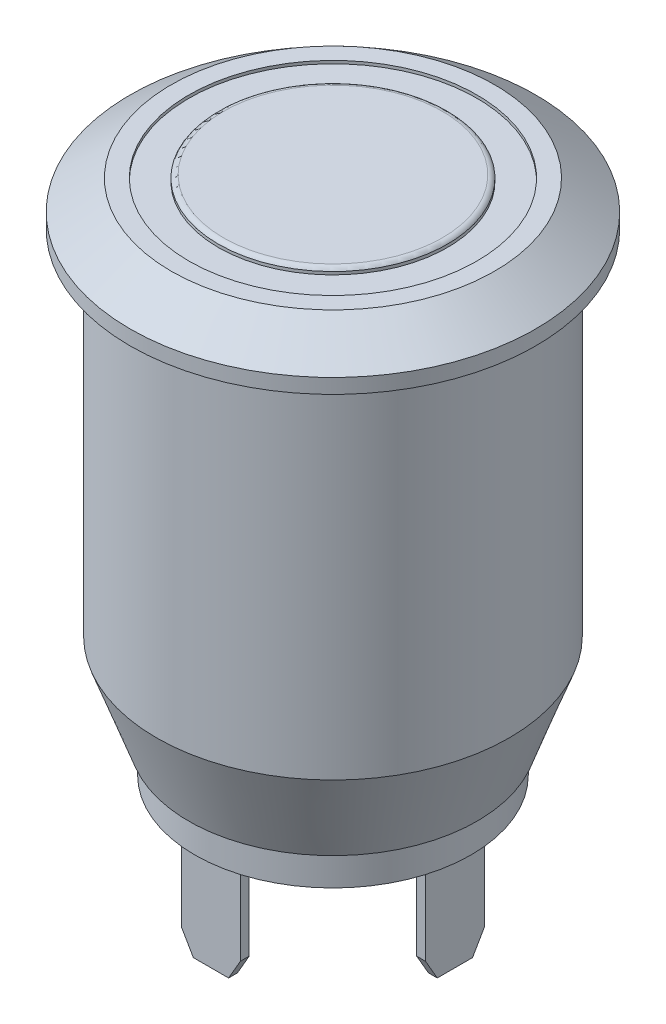
ISO-10303-21;
HEADER;
FILE_DESCRIPTION(('STEP AP214'),'2;1');
FILE_NAME('part.step','',(''),(''),'','','');
FILE_SCHEMA(('AUTOMOTIVE_DESIGN { 1 0 10303 214 1 1 1 1 }'));
ENDSEC;
DATA;
#1=APPLICATION_CONTEXT('core data for automotive mechanical design processes');
#2=APPLICATION_PROTOCOL_DEFINITION('international standard','automotive_design',2000,#1);
#3=PRODUCT_CONTEXT('',#1,'mechanical');
#4=PRODUCT('Part','Part','',(#3));
#5=PRODUCT_RELATED_PRODUCT_CATEGORY('part','',(#4));
#6=PRODUCT_DEFINITION_FORMATION('','',#4);
#7=PRODUCT_DEFINITION_CONTEXT('part definition',#1,'design');
#8=PRODUCT_DEFINITION('design','',#6,#7);
#9=PRODUCT_DEFINITION_SHAPE('','',#8);
#10=(LENGTH_UNIT() NAMED_UNIT(*) SI_UNIT(.MILLI.,.METRE.));
#11=(NAMED_UNIT(*) PLANE_ANGLE_UNIT() SI_UNIT($,.RADIAN.));
#12=(NAMED_UNIT(*) SI_UNIT($,.STERADIAN.) SOLID_ANGLE_UNIT());
#13=UNCERTAINTY_MEASURE_WITH_UNIT(LENGTH_MEASURE(1.E-05),#10,'distance_accuracy_value','');
#14=(GEOMETRIC_REPRESENTATION_CONTEXT(3) GLOBAL_UNCERTAINTY_ASSIGNED_CONTEXT((#13)) GLOBAL_UNIT_ASSIGNED_CONTEXT((#10,
#11,#12)) REPRESENTATION_CONTEXT('',''));
#15=CARTESIAN_POINT('',(0.,0.,0.));
#16=DIRECTION('',(0.,0.,1.));
#17=DIRECTION('',(1.,0.,0.));
#18=AXIS2_PLACEMENT_3D('',#15,#16,#17);
#19=CARTESIAN_POINT('',(0.,-16.1,4.7));
#20=DIRECTION('',(0.,-1.,0.));
#21=DIRECTION('',(0.,0.,-1.));
#22=AXIS2_PLACEMENT_3D('',#19,#20,#21);
#23=PLANE('',#22);
#24=CARTESIAN_POINT('',(0.,-16.1,0.));
#25=DIRECTION('',(0.,1.,0.));
#26=DIRECTION('',(0.,0.,1.));
#27=AXIS2_PLACEMENT_3D('',#24,#25,#26);
#28=CIRCLE('',#27,4.7);
#29=CARTESIAN_POINT('',(0.,-16.1,4.7));
#30=VERTEX_POINT('',#29);
#31=EDGE_CURVE('E320',#30,#30,#28,.T.);
#32=ORIENTED_EDGE('',*,*,#31,.F.);
#33=EDGE_LOOP('',(#32));
#34=FACE_BOUND('',#33,.T.);
#35=DIRECTION('',(0.,0.,-1.));
#36=VECTOR('',#35,1.);
#37=CARTESIAN_POINT('',(0.999999999999999,-16.1,4.15));
#38=LINE('',#37,#36);
#39=CARTESIAN_POINT('',(0.999999999999999,-16.1,4.15));
#40=VERTEX_POINT('',#39);
#41=CARTESIAN_POINT('',(0.999999999999999,-16.1,3.85));
#42=VERTEX_POINT('',#41);
#43=EDGE_CURVE('E295',#40,#42,#38,.T.);
#44=ORIENTED_EDGE('',*,*,#43,.T.);
#45=DIRECTION('',(1.,0.,0.));
#46=VECTOR('',#45,1.);
#47=CARTESIAN_POINT('',(-1.,-16.1,3.85));
#48=LINE('',#47,#46);
#49=CARTESIAN_POINT('',(-1.,-16.1,3.85));
#50=VERTEX_POINT('',#49);
#51=EDGE_CURVE('E284',#50,#42,#48,.T.);
#52=ORIENTED_EDGE('',*,*,#51,.F.);
#53=DIRECTION('',(0.,0.,1.));
#54=VECTOR('',#53,1.);
#55=CARTESIAN_POINT('',(-1.,-16.1,3.85));
#56=LINE('',#55,#54);
#57=CARTESIAN_POINT('',(-1.,-16.1,4.15));
#58=VERTEX_POINT('',#57);
#59=EDGE_CURVE('E289',#50,#58,#56,.T.);
#60=ORIENTED_EDGE('',*,*,#59,.T.);
#61=DIRECTION('',(1.,0.,0.));
#62=VECTOR('',#61,1.);
#63=CARTESIAN_POINT('',(-1.,-16.1,4.15));
#64=LINE('',#63,#62);
#65=EDGE_CURVE('E298',#58,#40,#64,.T.);
#66=ORIENTED_EDGE('',*,*,#65,.T.);
#67=EDGE_LOOP('',(#44,#52,#60,#66));
#68=FACE_BOUND('',#67,.T.);
#69=DIRECTION('',(0.,0.,-1.));
#70=VECTOR('',#69,1.);
#71=CARTESIAN_POINT('',(0.999999999999999,-16.1,-3.85));
#72=LINE('',#71,#70);
#73=CARTESIAN_POINT('',(0.999999999999999,-16.1,-3.85));
#74=VERTEX_POINT('',#73);
#75=CARTESIAN_POINT('',(0.999999999999999,-16.1,-4.15));
#76=VERTEX_POINT('',#75);
#77=EDGE_CURVE('E269',#74,#76,#72,.T.);
#78=ORIENTED_EDGE('',*,*,#77,.T.);
#79=DIRECTION('',(1.,0.,0.));
#80=VECTOR('',#79,1.);
#81=CARTESIAN_POINT('',(-1.,-16.1,-4.15));
#82=LINE('',#81,#80);
#83=CARTESIAN_POINT('',(-1.,-16.1,-4.15));
#84=VERTEX_POINT('',#83);
#85=EDGE_CURVE('E258',#84,#76,#82,.T.);
#86=ORIENTED_EDGE('',*,*,#85,.F.);
#87=DIRECTION('',(0.,0.,1.));
#88=VECTOR('',#87,1.);
#89=CARTESIAN_POINT('',(-1.,-16.1,-4.15));
#90=LINE('',#89,#88);
#91=CARTESIAN_POINT('',(-1.,-16.1,-3.85));
#92=VERTEX_POINT('',#91);
#93=EDGE_CURVE('E263',#84,#92,#90,.T.);
#94=ORIENTED_EDGE('',*,*,#93,.T.);
#95=DIRECTION('',(1.,0.,0.));
#96=VECTOR('',#95,1.);
#97=CARTESIAN_POINT('',(-1.,-16.1,-3.85));
#98=LINE('',#97,#96);
#99=EDGE_CURVE('E272',#92,#74,#98,.T.);
#100=ORIENTED_EDGE('',*,*,#99,.T.);
#101=EDGE_LOOP('',(#78,#86,#94,#100));
#102=FACE_BOUND('',#101,.T.);
#103=DIRECTION('',(-1.,0.,0.));
#104=VECTOR('',#103,1.);
#105=CARTESIAN_POINT('',(-3.85,-16.1,-1.));
#106=LINE('',#105,#104);
#107=CARTESIAN_POINT('',(-3.85,-16.1,-1.));
#108=VERTEX_POINT('',#107);
#109=CARTESIAN_POINT('',(-4.15,-16.1,-1.));
#110=VERTEX_POINT('',#109);
#111=EDGE_CURVE('E243',#108,#110,#106,.T.);
#112=ORIENTED_EDGE('',*,*,#111,.T.);
#113=DIRECTION('',(0.,0.,1.));
#114=VECTOR('',#113,1.);
#115=CARTESIAN_POINT('',(-4.15,-16.1,1.));
#116=LINE('',#115,#114);
#117=CARTESIAN_POINT('',(-4.15,-16.1,1.));
#118=VERTEX_POINT('',#117);
#119=EDGE_CURVE('E232',#118,#110,#116,.F.);
#120=ORIENTED_EDGE('',*,*,#119,.F.);
#121=DIRECTION('',(1.,0.,0.));
#122=VECTOR('',#121,1.);
#123=CARTESIAN_POINT('',(-4.15,-16.1,1.));
#124=LINE('',#123,#122);
#125=CARTESIAN_POINT('',(-3.85,-16.1,1.));
#126=VERTEX_POINT('',#125);
#127=EDGE_CURVE('E237',#118,#126,#124,.T.);
#128=ORIENTED_EDGE('',*,*,#127,.T.);
#129=DIRECTION('',(0.,0.,1.));
#130=VECTOR('',#129,1.);
#131=CARTESIAN_POINT('',(-3.85,-16.1,1.));
#132=LINE('',#131,#130);
#133=EDGE_CURVE('E246',#126,#108,#132,.F.);
#134=ORIENTED_EDGE('',*,*,#133,.T.);
#135=EDGE_LOOP('',(#112,#120,#128,#134));
#136=FACE_BOUND('',#135,.T.);
#137=DIRECTION('',(1.,0.,0.));
#138=VECTOR('',#137,1.);
#139=CARTESIAN_POINT('',(3.85,-16.1,1.));
#140=LINE('',#139,#138);
#141=CARTESIAN_POINT('',(3.85,-16.1,1.));
#142=VERTEX_POINT('',#141);
#143=CARTESIAN_POINT('',(4.15,-16.1,1.));
#144=VERTEX_POINT('',#143);
#145=EDGE_CURVE('E216',#142,#144,#140,.T.);
#146=ORIENTED_EDGE('',*,*,#145,.T.);
#147=DIRECTION('',(0.,0.,1.));
#148=VECTOR('',#147,1.);
#149=CARTESIAN_POINT('',(4.15,-16.1,-1.));
#150=LINE('',#149,#148);
#151=CARTESIAN_POINT('',(4.15,-16.1,-1.));
#152=VERTEX_POINT('',#151);
#153=EDGE_CURVE('E199',#152,#144,#150,.T.);
#154=ORIENTED_EDGE('',*,*,#153,.F.);
#155=DIRECTION('',(-1.,0.,0.));
#156=VECTOR('',#155,1.);
#157=CARTESIAN_POINT('',(4.15,-16.1,-1.));
#158=LINE('',#157,#156);
#159=CARTESIAN_POINT('',(3.85,-16.1,-1.));
#160=VERTEX_POINT('',#159);
#161=EDGE_CURVE('E213',#152,#160,#158,.T.);
#162=ORIENTED_EDGE('',*,*,#161,.T.);
#163=DIRECTION('',(0.,0.,1.));
#164=VECTOR('',#163,1.);
#165=CARTESIAN_POINT('',(3.85,-16.1,-1.));
#166=LINE('',#165,#164);
#167=EDGE_CURVE('E221',#160,#142,#166,.T.);
#168=ORIENTED_EDGE('',*,*,#167,.T.);
#169=EDGE_LOOP('',(#146,#154,#162,#168));
#170=FACE_BOUND('',#169,.T.);
#171=ADVANCED_FACE('F35',(#34,#68,#102,#136,#170),#23,.T.);
#172=CARTESIAN_POINT('',(0.,1.5,3.9));
#173=DIRECTION('',(0.,1.,0.));
#174=DIRECTION('',(0.,0.,1.));
#175=AXIS2_PLACEMENT_3D('',#172,#173,#174);
#176=PLANE('',#175);
#177=CARTESIAN_POINT('',(0.,1.5,0.));
#178=DIRECTION('',(0.,1.,0.));
#179=DIRECTION('',(0.,0.,1.));
#180=AXIS2_PLACEMENT_3D('',#177,#178,#179);
#181=CIRCLE('',#180,4.9);
#182=CARTESIAN_POINT('',(0.,1.5,4.9));
#183=VERTEX_POINT('',#182);
#184=EDGE_CURVE('E314',#183,#183,#181,.T.);
#185=ORIENTED_EDGE('',*,*,#184,.F.);
#186=EDGE_LOOP('',(#185));
#187=FACE_BOUND('',#186,.T.);
#188=CARTESIAN_POINT('',(0.,1.5,0.));
#189=DIRECTION('',(0.,1.,0.));
#190=DIRECTION('',(0.,0.,1.));
#191=AXIS2_PLACEMENT_3D('',#188,#189,#190);
#192=CIRCLE('',#191,5.5);
#193=CARTESIAN_POINT('',(0.,1.5,5.5));
#194=VERTEX_POINT('',#193);
#195=EDGE_CURVE('E337',#194,#194,#192,.T.);
#196=ORIENTED_EDGE('',*,*,#195,.T.);
#197=EDGE_LOOP('',(#196));
#198=FACE_BOUND('',#197,.T.);
#199=ADVANCED_FACE('F425',(#187,#198),#176,.T.);
#200=CARTESIAN_POINT('',(0.,1.5,0.));
#201=DIRECTION('',(0.,-1.,0.));
#202=DIRECTION('',(0.,0.,-1.));
#203=AXIS2_PLACEMENT_3D('',#200,#201,#202);
#204=CONICAL_SURFACE('',#203,5.5,0.950546840812076);
#205=CARTESIAN_POINT('',(0.,0.5,0.));
#206=DIRECTION('',(0.,1.,0.));
#207=DIRECTION('',(0.,0.,1.));
#208=AXIS2_PLACEMENT_3D('',#205,#206,#207);
#209=CIRCLE('',#208,6.9);
#210=CARTESIAN_POINT('',(0.,0.5,6.9));
#211=VERTEX_POINT('',#210);
#212=EDGE_CURVE('E334',#211,#211,#209,.T.);
#213=ORIENTED_EDGE('',*,*,#212,.T.);
#214=EDGE_LOOP('',(#213));
#215=FACE_BOUND('',#214,.T.);
#216=ORIENTED_EDGE('',*,*,#195,.F.);
#217=EDGE_LOOP('',(#216));
#218=FACE_BOUND('',#217,.T.);
#219=ADVANCED_FACE('F431',(#215,#218),#204,.T.);
#220=CARTESIAN_POINT('',(0.,14.375,0.));
#221=DIRECTION('',(0.,1.,0.));
#222=DIRECTION('',(0.,0.,1.));
#223=AXIS2_PLACEMENT_3D('',#220,#221,#222);
#224=CYLINDRICAL_SURFACE('',#223,6.9);
#225=CARTESIAN_POINT('',(0.,0.,0.));
#226=DIRECTION('',(0.,1.,0.));
#227=DIRECTION('',(0.,0.,1.));
#228=AXIS2_PLACEMENT_3D('',#225,#226,#227);
#229=CIRCLE('',#228,6.9);
#230=CARTESIAN_POINT('',(0.,0.,6.9));
#231=VERTEX_POINT('',#230);
#232=EDGE_CURVE('E331',#231,#231,#229,.T.);
#233=ORIENTED_EDGE('',*,*,#232,.T.);
#234=EDGE_LOOP('',(#233));
#235=FACE_BOUND('',#234,.T.);
#236=ORIENTED_EDGE('',*,*,#212,.F.);
#237=EDGE_LOOP('',(#236));
#238=FACE_BOUND('',#237,.T.);
#239=ADVANCED_FACE('F453',(#235,#238),#224,.T.);
#240=CARTESIAN_POINT('',(0.,0.,6.9));
#241=DIRECTION('',(0.,-1.,0.));
#242=DIRECTION('',(0.,0.,-1.));
#243=AXIS2_PLACEMENT_3D('',#240,#241,#242);
#244=PLANE('',#243);
#245=CARTESIAN_POINT('',(0.,0.,0.));
#246=DIRECTION('',(0.,1.,0.));
#247=DIRECTION('',(0.,0.,1.));
#248=AXIS2_PLACEMENT_3D('',#245,#246,#247);
#249=CIRCLE('',#248,6.);
#250=CARTESIAN_POINT('',(0.,0.,6.));
#251=VERTEX_POINT('',#250);
#252=EDGE_CURVE('E328',#251,#251,#249,.T.);
#253=ORIENTED_EDGE('',*,*,#252,.T.);
#254=EDGE_LOOP('',(#253));
#255=FACE_BOUND('',#254,.T.);
#256=ORIENTED_EDGE('',*,*,#232,.F.);
#257=EDGE_LOOP('',(#256));
#258=FACE_BOUND('',#257,.T.);
#259=ADVANCED_FACE('F450',(#255,#258),#244,.T.);
#260=CARTESIAN_POINT('',(0.,14.375,0.));
#261=DIRECTION('',(0.,1.,0.));
#262=DIRECTION('',(0.,0.,1.));
#263=AXIS2_PLACEMENT_3D('',#260,#261,#262);
#264=CYLINDRICAL_SURFACE('',#263,6.);
#265=CARTESIAN_POINT('',(0.,-12.,0.));
#266=DIRECTION('',(0.,-1.,0.));
#267=DIRECTION('',(0.,0.,-1.));
#268=AXIS2_PLACEMENT_3D('',#265,#266,#267);
#269=CIRCLE('',#268,6.);
#270=CARTESIAN_POINT('',(0.,-12.,-6.));
#271=VERTEX_POINT('',#270);
#272=EDGE_CURVE('E43',#271,#271,#269,.F.);
#273=ORIENTED_EDGE('',*,*,#272,.T.);
#274=EDGE_LOOP('',(#273));
#275=FACE_BOUND('',#274,.T.);
#276=ORIENTED_EDGE('',*,*,#252,.F.);
#277=EDGE_LOOP('',(#276));
#278=FACE_BOUND('',#277,.T.);
#279=ADVANCED_FACE('F413',(#275,#278),#264,.T.);
#280=CARTESIAN_POINT('',(0.,-15.,6.));
#281=DIRECTION('',(0.,-1.,0.));
#282=DIRECTION('',(0.,0.,-1.));
#283=AXIS2_PLACEMENT_3D('',#280,#281,#282);
#284=PLANE('',#283);
#285=CARTESIAN_POINT('',(0.,-15.,0.));
#286=DIRECTION('',(0.,-1.,0.));
#287=DIRECTION('',(0.,0.,-1.));
#288=AXIS2_PLACEMENT_3D('',#285,#286,#287);
#289=CIRCLE('',#288,4.90808929720139);
#290=CARTESIAN_POINT('',(0.,-15.,-4.90808929720139));
#291=VERTEX_POINT('',#290);
#292=EDGE_CURVE('E11',#291,#291,#289,.T.);
#293=ORIENTED_EDGE('',*,*,#292,.T.);
#294=EDGE_LOOP('',(#293));
#295=FACE_BOUND('',#294,.T.);
#296=CARTESIAN_POINT('',(0.,-15.,0.));
#297=DIRECTION('',(0.,1.,0.));
#298=DIRECTION('',(0.,0.,1.));
#299=AXIS2_PLACEMENT_3D('',#296,#297,#298);
#300=CIRCLE('',#299,4.7);
#301=CARTESIAN_POINT('',(0.,-15.,4.7));
#302=VERTEX_POINT('',#301);
#303=EDGE_CURVE('E325',#302,#302,#300,.T.);
#304=ORIENTED_EDGE('',*,*,#303,.T.);
#305=EDGE_LOOP('',(#304));
#306=FACE_BOUND('',#305,.T.);
#307=ADVANCED_FACE('F443',(#295,#306),#284,.T.);
#308=CARTESIAN_POINT('',(0.,14.375,0.));
#309=DIRECTION('',(0.,1.,0.));
#310=DIRECTION('',(0.,0.,1.));
#311=AXIS2_PLACEMENT_3D('',#308,#309,#310);
#312=CYLINDRICAL_SURFACE('',#311,4.7);
#313=ORIENTED_EDGE('',*,*,#31,.T.);
#314=EDGE_LOOP('',(#313));
#315=FACE_BOUND('',#314,.T.);
#316=ORIENTED_EDGE('',*,*,#303,.F.);
#317=EDGE_LOOP('',(#316));
#318=FACE_BOUND('',#317,.T.);
#319=ADVANCED_FACE('F440',(#315,#318),#312,.T.);
#320=CARTESIAN_POINT('',(0.,1.4,0.));
#321=DIRECTION('',(0.,1.,0.));
#322=DIRECTION('',(0.,0.,1.));
#323=AXIS2_PLACEMENT_3D('',#320,#321,#322);
#324=CYLINDRICAL_SURFACE('',#323,4.9);
#325=CARTESIAN_POINT('',(0.,1.4,0.));
#326=DIRECTION('',(0.,1.,0.));
#327=DIRECTION('',(0.,0.,1.));
#328=AXIS2_PLACEMENT_3D('',#325,#326,#327);
#329=CIRCLE('',#328,4.9);
#330=CARTESIAN_POINT('',(0.,1.4,4.9));
#331=VERTEX_POINT('',#330);
#332=EDGE_CURVE('E317',#331,#331,#329,.T.);
#333=ORIENTED_EDGE('',*,*,#332,.F.);
#334=EDGE_LOOP('',(#333));
#335=FACE_BOUND('',#334,.T.);
#336=ORIENTED_EDGE('',*,*,#184,.T.);
#337=EDGE_LOOP('',(#336));
#338=FACE_BOUND('',#337,.T.);
#339=ADVANCED_FACE('F438',(#335,#338),#324,.F.);
#340=CARTESIAN_POINT('',(0.,1.4,0.));
#341=DIRECTION('',(0.,1.,0.));
#342=DIRECTION('',(0.,0.,1.));
#343=AXIS2_PLACEMENT_3D('',#340,#341,#342);
#344=PLANE('',#343);
#345=CARTESIAN_POINT('',(0.,1.4,0.));
#346=DIRECTION('',(0.,1.,0.));
#347=DIRECTION('',(0.,0.,1.));
#348=AXIS2_PLACEMENT_3D('',#345,#346,#347);
#349=CIRCLE('',#348,3.9);
#350=CARTESIAN_POINT('',(0.,1.4,3.9));
#351=VERTEX_POINT('',#350);
#352=EDGE_CURVE('E311',#351,#351,#349,.T.);
#353=ORIENTED_EDGE('',*,*,#352,.F.);
#354=EDGE_LOOP('',(#353));
#355=FACE_BOUND('',#354,.T.);
#356=ORIENTED_EDGE('',*,*,#332,.T.);
#357=EDGE_LOOP('',(#356));
#358=FACE_BOUND('',#357,.T.);
#359=ADVANCED_FACE('F584',(#355,#358),#344,.T.);
#360=CARTESIAN_POINT('',(0.,1.4,0.));
#361=DIRECTION('',(0.,1.,0.));
#362=DIRECTION('',(0.,0.,1.));
#363=AXIS2_PLACEMENT_3D('',#360,#361,#362);
#364=CYLINDRICAL_SURFACE('',#363,3.9);
#365=ORIENTED_EDGE('',*,*,#352,.T.);
#366=EDGE_LOOP('',(#365));
#367=FACE_BOUND('',#366,.T.);
#368=CARTESIAN_POINT('',(0.,1.5,0.));
#369=DIRECTION('',(0.,1.,0.));
#370=DIRECTION('',(0.,0.,1.));
#371=AXIS2_PLACEMENT_3D('',#368,#369,#370);
#372=CIRCLE('',#371,3.9);
#373=CARTESIAN_POINT('',(0.,1.5,3.9));
#374=VERTEX_POINT('',#373);
#375=EDGE_CURVE('E310',#374,#374,#372,.T.);
#376=ORIENTED_EDGE('',*,*,#375,.F.);
#377=EDGE_LOOP('',(#376));
#378=FACE_BOUND('',#377,.T.);
#379=ADVANCED_FACE('F465',(#367,#378),#364,.T.);
#380=CARTESIAN_POINT('',(0.,1.6,0.));
#381=DIRECTION('',(0.,1.,0.));
#382=DIRECTION('',(0.,0.,1.));
#383=AXIS2_PLACEMENT_3D('',#380,#381,#382);
#384=PLANE('',#383);
#385=CARTESIAN_POINT('',(0.,1.6,0.));
#386=DIRECTION('',(0.,1.,0.));
#387=DIRECTION('',(0.,0.,1.));
#388=AXIS2_PLACEMENT_3D('',#385,#386,#387);
#389=CIRCLE('',#388,3.72679491924311);
#390=CARTESIAN_POINT('',(0.,1.6,3.72679491924311));
#391=VERTEX_POINT('',#390);
#392=EDGE_CURVE('E340',#391,#391,#389,.T.);
#393=ORIENTED_EDGE('',*,*,#392,.T.);
#394=EDGE_LOOP('',(#393));
#395=FACE_BOUND('',#394,.T.);
#396=ADVANCED_FACE('F461',(#395),#384,.T.);
#397=CARTESIAN_POINT('',(0.,1.4,0.));
#398=DIRECTION('',(0.,-1.,0.));
#399=DIRECTION('',(0.,0.,-1.));
#400=AXIS2_PLACEMENT_3D('',#397,#398,#399);
#401=TOROIDAL_SURFACE('',#400,3.72679491924311,0.2);
#402=ORIENTED_EDGE('',*,*,#375,.T.);
#403=EDGE_LOOP('',(#402));
#404=FACE_BOUND('',#403,.T.);
#405=ORIENTED_EDGE('',*,*,#392,.F.);
#406=EDGE_LOOP('',(#405));
#407=FACE_BOUND('',#406,.T.);
#408=ADVANCED_FACE('F464',(#404,#407),#401,.T.);
#409=CARTESIAN_POINT('',(-1.,-19.7,3.85));
#410=DIRECTION('',(0.,0.,1.));
#411=DIRECTION('',(1.,0.,0.));
#412=AXIS2_PLACEMENT_3D('',#409,#410,#411);
#413=PLANE('',#412);
#414=DIRECTION('',(1.,0.,0.));
#415=VECTOR('',#414,1.);
#416=CARTESIAN_POINT('',(-1.,-19.7,3.85));
#417=LINE('',#416,#415);
#418=CARTESIAN_POINT('',(-0.600000000000001,-19.7,3.85));
#419=VERTEX_POINT('',#418);
#420=CARTESIAN_POINT('',(0.6,-19.7,3.85));
#421=VERTEX_POINT('',#420);
#422=EDGE_CURVE('E285',#419,#421,#417,.T.);
#423=ORIENTED_EDGE('',*,*,#422,.F.);
#424=DIRECTION('',(-0.499999999999998,0.86602540378444,0.));
#425=VECTOR('',#424,1.);
#426=CARTESIAN_POINT('',(-1.,-19.0071796769724,3.85));
#427=LINE('',#426,#425);
#428=CARTESIAN_POINT('',(-1.,-19.0071796769724,3.85));
#429=VERTEX_POINT('',#428);
#430=EDGE_CURVE('E356',#419,#429,#427,.T.);
#431=ORIENTED_EDGE('',*,*,#430,.T.);
#432=DIRECTION('',(0.,1.,0.));
#433=VECTOR('',#432,1.);
#434=CARTESIAN_POINT('',(-1.,-19.7,3.85));
#435=LINE('',#434,#433);
#436=EDGE_CURVE('E292',#429,#50,#435,.T.);
#437=ORIENTED_EDGE('',*,*,#436,.T.);
#438=ORIENTED_EDGE('',*,*,#51,.T.);
#439=DIRECTION('',(0.,1.,0.));
#440=VECTOR('',#439,1.);
#441=CARTESIAN_POINT('',(0.999999999999999,-19.7,3.85));
#442=LINE('',#441,#440);
#443=CARTESIAN_POINT('',(0.999999999999999,-19.0071796769724,3.85));
#444=VERTEX_POINT('',#443);
#445=EDGE_CURVE('E308',#444,#42,#442,.T.);
#446=ORIENTED_EDGE('',*,*,#445,.F.);
#447=DIRECTION('',(-0.499999999999998,-0.86602540378444,0.));
#448=VECTOR('',#447,1.);
#449=CARTESIAN_POINT('',(0.999999999999999,-19.0071796769724,3.85));
#450=LINE('',#449,#448);
#451=EDGE_CURVE('E354',#444,#421,#450,.T.);
#452=ORIENTED_EDGE('',*,*,#451,.T.);
#453=EDGE_LOOP('',(#423,#431,#437,#438,#446,#452));
#454=FACE_BOUND('',#453,.T.);
#455=ADVANCED_FACE('F469',(#454),#413,.F.);
#456=CARTESIAN_POINT('',(0.999999999999999,-19.7,4.15));
#457=DIRECTION('',(1.,0.,0.));
#458=DIRECTION('',(0.,0.,-1.));
#459=AXIS2_PLACEMENT_3D('',#456,#457,#458);
#460=PLANE('',#459);
#461=DIRECTION('',(0.,1.,0.));
#462=VECTOR('',#461,1.);
#463=CARTESIAN_POINT('',(0.999999999999999,-19.7,4.15));
#464=LINE('',#463,#462);
#465=CARTESIAN_POINT('',(0.999999999999999,-19.0071796769724,4.15));
#466=VERTEX_POINT('',#465);
#467=EDGE_CURVE('E306',#466,#40,#464,.T.);
#468=ORIENTED_EDGE('',*,*,#467,.F.);
#469=DIRECTION('',(0.,0.,-1.));
#470=VECTOR('',#469,1.);
#471=CARTESIAN_POINT('',(0.999999999999999,-19.0071796769724,3.85));
#472=LINE('',#471,#470);
#473=EDGE_CURVE('E358',#466,#444,#472,.T.);
#474=ORIENTED_EDGE('',*,*,#473,.T.);
#475=ORIENTED_EDGE('',*,*,#445,.T.);
#476=ORIENTED_EDGE('',*,*,#43,.F.);
#477=EDGE_LOOP('',(#468,#474,#475,#476));
#478=FACE_BOUND('',#477,.T.);
#479=ADVANCED_FACE('F575',(#478),#460,.T.);
#480=CARTESIAN_POINT('',(-1.,-19.7,4.15));
#481=DIRECTION('',(0.,0.,1.));
#482=DIRECTION('',(1.,0.,0.));
#483=AXIS2_PLACEMENT_3D('',#480,#481,#482);
#484=PLANE('',#483);
#485=DIRECTION('',(0.,1.,0.));
#486=VECTOR('',#485,1.);
#487=CARTESIAN_POINT('',(-1.,-19.7,4.15));
#488=LINE('',#487,#486);
#489=CARTESIAN_POINT('',(-1.,-19.0071796769724,4.15));
#490=VERTEX_POINT('',#489);
#491=EDGE_CURVE('E304',#490,#58,#488,.T.);
#492=ORIENTED_EDGE('',*,*,#491,.F.);
#493=DIRECTION('',(0.499999999999998,-0.86602540378444,0.));
#494=VECTOR('',#493,1.);
#495=CARTESIAN_POINT('',(-0.700000000000001,-19.5267949192431,4.15));
#496=LINE('',#495,#494);
#497=CARTESIAN_POINT('',(-0.600000000000001,-19.7,4.15));
#498=VERTEX_POINT('',#497);
#499=EDGE_CURVE('E348',#490,#498,#496,.T.);
#500=ORIENTED_EDGE('',*,*,#499,.T.);
#501=DIRECTION('',(1.,0.,0.));
#502=VECTOR('',#501,1.);
#503=CARTESIAN_POINT('',(-1.,-19.7,4.15));
#504=LINE('',#503,#502);
#505=CARTESIAN_POINT('',(0.6,-19.7,4.15));
#506=VERTEX_POINT('',#505);
#507=EDGE_CURVE('E288',#498,#506,#504,.T.);
#508=ORIENTED_EDGE('',*,*,#507,.T.);
#509=DIRECTION('',(0.499999999999998,0.86602540378444,0.));
#510=VECTOR('',#509,1.);
#511=CARTESIAN_POINT('',(0.200000000000002,-20.3928203230275,4.15));
#512=LINE('',#511,#510);
#513=EDGE_CURVE('E346',#506,#466,#512,.T.);
#514=ORIENTED_EDGE('',*,*,#513,.T.);
#515=ORIENTED_EDGE('',*,*,#467,.T.);
#516=ORIENTED_EDGE('',*,*,#65,.F.);
#517=EDGE_LOOP('',(#492,#500,#508,#514,#515,#516));
#518=FACE_BOUND('',#517,.T.);
#519=ADVANCED_FACE('F571',(#518),#484,.T.);
#520=CARTESIAN_POINT('',(-1.,-19.7,3.85));
#521=DIRECTION('',(-1.,0.,0.));
#522=DIRECTION('',(0.,0.,1.));
#523=AXIS2_PLACEMENT_3D('',#520,#521,#522);
#524=PLANE('',#523);
#525=ORIENTED_EDGE('',*,*,#436,.F.);
#526=DIRECTION('',(0.,0.,1.));
#527=VECTOR('',#526,1.);
#528=CARTESIAN_POINT('',(-1.,-19.0071796769724,4.15));
#529=LINE('',#528,#527);
#530=EDGE_CURVE('E343',#429,#490,#529,.T.);
#531=ORIENTED_EDGE('',*,*,#530,.T.);
#532=ORIENTED_EDGE('',*,*,#491,.T.);
#533=ORIENTED_EDGE('',*,*,#59,.F.);
#534=EDGE_LOOP('',(#525,#531,#532,#533));
#535=FACE_BOUND('',#534,.T.);
#536=ADVANCED_FACE('F567',(#535),#524,.T.);
#537=CARTESIAN_POINT('',(0.,-19.7,0.));
#538=DIRECTION('',(0.,1.,0.));
#539=DIRECTION('',(-1.,0.,0.));
#540=AXIS2_PLACEMENT_3D('',#537,#538,#539);
#541=PLANE('',#540);
#542=ORIENTED_EDGE('',*,*,#507,.F.);
#543=DIRECTION('',(0.,0.,-1.));
#544=VECTOR('',#543,1.);
#545=CARTESIAN_POINT('',(-0.600000000000001,-19.7,3.85));
#546=LINE('',#545,#544);
#547=EDGE_CURVE('E352',#498,#419,#546,.T.);
#548=ORIENTED_EDGE('',*,*,#547,.T.);
#549=ORIENTED_EDGE('',*,*,#422,.T.);
#550=DIRECTION('',(0.,0.,1.));
#551=VECTOR('',#550,1.);
#552=CARTESIAN_POINT('',(0.6,-19.7,4.15));
#553=LINE('',#552,#551);
#554=EDGE_CURVE('E350',#421,#506,#553,.T.);
#555=ORIENTED_EDGE('',*,*,#554,.T.);
#556=EDGE_LOOP('',(#542,#548,#549,#555));
#557=FACE_BOUND('',#556,.T.);
#558=ADVANCED_FACE('F563',(#557),#541,.F.);
#559=CARTESIAN_POINT('',(-1.,-19.7,-4.15));
#560=DIRECTION('',(0.,0.,1.));
#561=DIRECTION('',(1.,0.,0.));
#562=AXIS2_PLACEMENT_3D('',#559,#560,#561);
#563=PLANE('',#562);
#564=DIRECTION('',(1.,0.,0.));
#565=VECTOR('',#564,1.);
#566=CARTESIAN_POINT('',(-1.,-19.7,-4.15));
#567=LINE('',#566,#565);
#568=CARTESIAN_POINT('',(-0.600000000000001,-19.7,-4.15));
#569=VERTEX_POINT('',#568);
#570=CARTESIAN_POINT('',(0.6,-19.7,-4.15));
#571=VERTEX_POINT('',#570);
#572=EDGE_CURVE('E259',#569,#571,#567,.T.);
#573=ORIENTED_EDGE('',*,*,#572,.F.);
#574=DIRECTION('',(-0.499999999999998,0.86602540378444,0.));
#575=VECTOR('',#574,1.);
#576=CARTESIAN_POINT('',(-1.,-19.0071796769724,-4.15));
#577=LINE('',#576,#575);
#578=CARTESIAN_POINT('',(-1.,-19.0071796769724,-4.15));
#579=VERTEX_POINT('',#578);
#580=EDGE_CURVE('E392',#569,#579,#577,.T.);
#581=ORIENTED_EDGE('',*,*,#580,.T.);
#582=DIRECTION('',(0.,1.,0.));
#583=VECTOR('',#582,1.);
#584=CARTESIAN_POINT('',(-1.,-19.7,-4.15));
#585=LINE('',#584,#583);
#586=EDGE_CURVE('E266',#579,#84,#585,.T.);
#587=ORIENTED_EDGE('',*,*,#586,.T.);
#588=ORIENTED_EDGE('',*,*,#85,.T.);
#589=DIRECTION('',(0.,1.,0.));
#590=VECTOR('',#589,1.);
#591=CARTESIAN_POINT('',(0.999999999999999,-19.7,-4.15));
#592=LINE('',#591,#590);
#593=CARTESIAN_POINT('',(0.999999999999999,-19.0071796769724,-4.15));
#594=VERTEX_POINT('',#593);
#595=EDGE_CURVE('E282',#594,#76,#592,.T.);
#596=ORIENTED_EDGE('',*,*,#595,.F.);
#597=DIRECTION('',(-0.499999999999998,-0.86602540378444,0.));
#598=VECTOR('',#597,1.);
#599=CARTESIAN_POINT('',(0.999999999999999,-19.0071796769724,-4.15));
#600=LINE('',#599,#598);
#601=EDGE_CURVE('E390',#594,#571,#600,.T.);
#602=ORIENTED_EDGE('',*,*,#601,.T.);
#603=EDGE_LOOP('',(#573,#581,#587,#588,#596,#602));
#604=FACE_BOUND('',#603,.T.);
#605=ADVANCED_FACE('F559',(#604),#563,.F.);
#606=CARTESIAN_POINT('',(0.999999999999999,-19.7,-3.85));
#607=DIRECTION('',(1.,0.,0.));
#608=DIRECTION('',(0.,0.,-1.));
#609=AXIS2_PLACEMENT_3D('',#606,#607,#608);
#610=PLANE('',#609);
#611=DIRECTION('',(0.,1.,0.));
#612=VECTOR('',#611,1.);
#613=CARTESIAN_POINT('',(0.999999999999999,-19.7,-3.85));
#614=LINE('',#613,#612);
#615=CARTESIAN_POINT('',(0.999999999999999,-19.0071796769724,-3.85));
#616=VERTEX_POINT('',#615);
#617=EDGE_CURVE('E280',#616,#74,#614,.T.);
#618=ORIENTED_EDGE('',*,*,#617,.F.);
#619=DIRECTION('',(0.,0.,-1.));
#620=VECTOR('',#619,1.);
#621=CARTESIAN_POINT('',(0.999999999999999,-19.0071796769724,-4.15));
#622=LINE('',#621,#620);
#623=EDGE_CURVE('E394',#616,#594,#622,.T.);
#624=ORIENTED_EDGE('',*,*,#623,.T.);
#625=ORIENTED_EDGE('',*,*,#595,.T.);
#626=ORIENTED_EDGE('',*,*,#77,.F.);
#627=EDGE_LOOP('',(#618,#624,#625,#626));
#628=FACE_BOUND('',#627,.T.);
#629=ADVANCED_FACE('F555',(#628),#610,.T.);
#630=CARTESIAN_POINT('',(-1.,-19.7,-3.85));
#631=DIRECTION('',(0.,0.,1.));
#632=DIRECTION('',(1.,0.,0.));
#633=AXIS2_PLACEMENT_3D('',#630,#631,#632);
#634=PLANE('',#633);
#635=DIRECTION('',(0.,1.,0.));
#636=VECTOR('',#635,1.);
#637=CARTESIAN_POINT('',(-1.,-19.7,-3.85));
#638=LINE('',#637,#636);
#639=CARTESIAN_POINT('',(-1.,-19.0071796769724,-3.85));
#640=VERTEX_POINT('',#639);
#641=EDGE_CURVE('E278',#640,#92,#638,.T.);
#642=ORIENTED_EDGE('',*,*,#641,.F.);
#643=DIRECTION('',(0.499999999999998,-0.86602540378444,0.));
#644=VECTOR('',#643,1.);
#645=CARTESIAN_POINT('',(-0.700000000000001,-19.5267949192431,-3.85));
#646=LINE('',#645,#644);
#647=CARTESIAN_POINT('',(-0.600000000000001,-19.7,-3.85));
#648=VERTEX_POINT('',#647);
#649=EDGE_CURVE('E384',#640,#648,#646,.T.);
#650=ORIENTED_EDGE('',*,*,#649,.T.);
#651=DIRECTION('',(1.,0.,0.));
#652=VECTOR('',#651,1.);
#653=CARTESIAN_POINT('',(-1.,-19.7,-3.85));
#654=LINE('',#653,#652);
#655=CARTESIAN_POINT('',(0.6,-19.7,-3.85));
#656=VERTEX_POINT('',#655);
#657=EDGE_CURVE('E262',#648,#656,#654,.T.);
#658=ORIENTED_EDGE('',*,*,#657,.T.);
#659=DIRECTION('',(0.499999999999998,0.86602540378444,0.));
#660=VECTOR('',#659,1.);
#661=CARTESIAN_POINT('',(0.200000000000002,-20.3928203230275,-3.85));
#662=LINE('',#661,#660);
#663=EDGE_CURVE('E382',#656,#616,#662,.T.);
#664=ORIENTED_EDGE('',*,*,#663,.T.);
#665=ORIENTED_EDGE('',*,*,#617,.T.);
#666=ORIENTED_EDGE('',*,*,#99,.F.);
#667=EDGE_LOOP('',(#642,#650,#658,#664,#665,#666));
#668=FACE_BOUND('',#667,.T.);
#669=ADVANCED_FACE('F551',(#668),#634,.T.);
#670=CARTESIAN_POINT('',(-1.,-19.7,-4.15));
#671=DIRECTION('',(-1.,0.,0.));
#672=DIRECTION('',(0.,0.,1.));
#673=AXIS2_PLACEMENT_3D('',#670,#671,#672);
#674=PLANE('',#673);
#675=ORIENTED_EDGE('',*,*,#586,.F.);
#676=DIRECTION('',(0.,0.,1.));
#677=VECTOR('',#676,1.);
#678=CARTESIAN_POINT('',(-1.,-19.0071796769724,-3.85));
#679=LINE('',#678,#677);
#680=EDGE_CURVE('E379',#579,#640,#679,.T.);
#681=ORIENTED_EDGE('',*,*,#680,.T.);
#682=ORIENTED_EDGE('',*,*,#641,.T.);
#683=ORIENTED_EDGE('',*,*,#93,.F.);
#684=EDGE_LOOP('',(#675,#681,#682,#683));
#685=FACE_BOUND('',#684,.T.);
#686=ADVANCED_FACE('F547',(#685),#674,.T.);
#687=CARTESIAN_POINT('',(0.,-19.7,0.));
#688=DIRECTION('',(0.,1.,0.));
#689=DIRECTION('',(-1.,0.,0.));
#690=AXIS2_PLACEMENT_3D('',#687,#688,#689);
#691=PLANE('',#690);
#692=ORIENTED_EDGE('',*,*,#657,.F.);
#693=DIRECTION('',(0.,0.,-1.));
#694=VECTOR('',#693,1.);
#695=CARTESIAN_POINT('',(-0.600000000000001,-19.7,-4.15));
#696=LINE('',#695,#694);
#697=EDGE_CURVE('E388',#648,#569,#696,.T.);
#698=ORIENTED_EDGE('',*,*,#697,.T.);
#699=ORIENTED_EDGE('',*,*,#572,.T.);
#700=DIRECTION('',(0.,0.,1.));
#701=VECTOR('',#700,1.);
#702=CARTESIAN_POINT('',(0.6,-19.7,-3.85));
#703=LINE('',#702,#701);
#704=EDGE_CURVE('E386',#571,#656,#703,.T.);
#705=ORIENTED_EDGE('',*,*,#704,.T.);
#706=EDGE_LOOP('',(#692,#698,#699,#705));
#707=FACE_BOUND('',#706,.T.);
#708=ADVANCED_FACE('F543',(#707),#691,.F.);
#709=CARTESIAN_POINT('',(-4.15,-19.7,1.));
#710=DIRECTION('',(1.,0.,0.));
#711=DIRECTION('',(0.,0.,-1.));
#712=AXIS2_PLACEMENT_3D('',#709,#710,#711);
#713=PLANE('',#712);
#714=DIRECTION('',(0.,0.,1.));
#715=VECTOR('',#714,1.);
#716=CARTESIAN_POINT('',(-4.15,-19.7,1.));
#717=LINE('',#716,#715);
#718=CARTESIAN_POINT('',(-4.15,-19.7,0.600000000000001));
#719=VERTEX_POINT('',#718);
#720=CARTESIAN_POINT('',(-4.15,-19.7,-0.600000000000001));
#721=VERTEX_POINT('',#720);
#722=EDGE_CURVE('E233',#719,#721,#717,.F.);
#723=ORIENTED_EDGE('',*,*,#722,.F.);
#724=DIRECTION('',(0.,-0.86602540378444,-0.499999999999998));
#725=VECTOR('',#724,1.);
#726=CARTESIAN_POINT('',(-4.15,-19.0071796769724,1.));
#727=LINE('',#726,#725);
#728=CARTESIAN_POINT('',(-4.15,-19.0071796769724,1.));
#729=VERTEX_POINT('',#728);
#730=EDGE_CURVE('E374',#719,#729,#727,.F.);
#731=ORIENTED_EDGE('',*,*,#730,.T.);
#732=DIRECTION('',(0.,1.,0.));
#733=VECTOR('',#732,1.);
#734=CARTESIAN_POINT('',(-4.15,-19.7,1.));
#735=LINE('',#734,#733);
#736=EDGE_CURVE('E240',#729,#118,#735,.T.);
#737=ORIENTED_EDGE('',*,*,#736,.T.);
#738=ORIENTED_EDGE('',*,*,#119,.T.);
#739=DIRECTION('',(0.,1.,0.));
#740=VECTOR('',#739,1.);
#741=CARTESIAN_POINT('',(-4.15,-19.7,-1.));
#742=LINE('',#741,#740);
#743=CARTESIAN_POINT('',(-4.15,-19.0071796769724,-1.));
#744=VERTEX_POINT('',#743);
#745=EDGE_CURVE('E256',#744,#110,#742,.T.);
#746=ORIENTED_EDGE('',*,*,#745,.F.);
#747=DIRECTION('',(0.,0.86602540378444,-0.499999999999998));
#748=VECTOR('',#747,1.);
#749=CARTESIAN_POINT('',(-4.15,-19.0071796769724,-1.));
#750=LINE('',#749,#748);
#751=EDGE_CURVE('E372',#744,#721,#750,.F.);
#752=ORIENTED_EDGE('',*,*,#751,.T.);
#753=EDGE_LOOP('',(#723,#731,#737,#738,#746,#752));
#754=FACE_BOUND('',#753,.T.);
#755=ADVANCED_FACE('F539',(#754),#713,.F.);
#756=CARTESIAN_POINT('',(-3.85,-19.7,-1.));
#757=DIRECTION('',(0.,0.,-1.));
#758=DIRECTION('',(-1.,0.,0.));
#759=AXIS2_PLACEMENT_3D('',#756,#757,#758);
#760=PLANE('',#759);
#761=DIRECTION('',(0.,1.,0.));
#762=VECTOR('',#761,1.);
#763=CARTESIAN_POINT('',(-3.85,-19.7,-1.));
#764=LINE('',#763,#762);
#765=CARTESIAN_POINT('',(-3.85,-19.0071796769724,-1.));
#766=VERTEX_POINT('',#765);
#767=EDGE_CURVE('E254',#766,#108,#764,.T.);
#768=ORIENTED_EDGE('',*,*,#767,.F.);
#769=DIRECTION('',(-1.,0.,0.));
#770=VECTOR('',#769,1.);
#771=CARTESIAN_POINT('',(-3.85,-19.0071796769724,-1.));
#772=LINE('',#771,#770);
#773=EDGE_CURVE('E376',#766,#744,#772,.T.);
#774=ORIENTED_EDGE('',*,*,#773,.T.);
#775=ORIENTED_EDGE('',*,*,#745,.T.);
#776=ORIENTED_EDGE('',*,*,#111,.F.);
#777=EDGE_LOOP('',(#768,#774,#775,#776));
#778=FACE_BOUND('',#777,.T.);
#779=ADVANCED_FACE('F535',(#778),#760,.T.);
#780=CARTESIAN_POINT('',(-3.85,-19.7,1.));
#781=DIRECTION('',(1.,0.,0.));
#782=DIRECTION('',(0.,0.,-1.));
#783=AXIS2_PLACEMENT_3D('',#780,#781,#782);
#784=PLANE('',#783);
#785=DIRECTION('',(0.,1.,0.));
#786=VECTOR('',#785,1.);
#787=CARTESIAN_POINT('',(-3.85,-19.7,1.));
#788=LINE('',#787,#786);
#789=CARTESIAN_POINT('',(-3.85,-19.0071796769724,1.));
#790=VERTEX_POINT('',#789);
#791=EDGE_CURVE('E252',#790,#126,#788,.T.);
#792=ORIENTED_EDGE('',*,*,#791,.F.);
#793=DIRECTION('',(0.,0.86602540378444,0.499999999999998));
#794=VECTOR('',#793,1.);
#795=CARTESIAN_POINT('',(-3.85,-19.5267949192431,0.7));
#796=LINE('',#795,#794);
#797=CARTESIAN_POINT('',(-3.85,-19.7,0.600000000000001));
#798=VERTEX_POINT('',#797);
#799=EDGE_CURVE('E366',#790,#798,#796,.F.);
#800=ORIENTED_EDGE('',*,*,#799,.T.);
#801=DIRECTION('',(0.,0.,1.));
#802=VECTOR('',#801,1.);
#803=CARTESIAN_POINT('',(-3.85,-19.7,1.));
#804=LINE('',#803,#802);
#805=CARTESIAN_POINT('',(-3.85,-19.7,-0.600000000000001));
#806=VERTEX_POINT('',#805);
#807=EDGE_CURVE('E236',#798,#806,#804,.F.);
#808=ORIENTED_EDGE('',*,*,#807,.T.);
#809=DIRECTION('',(0.,-0.86602540378444,0.499999999999998));
#810=VECTOR('',#809,1.);
#811=CARTESIAN_POINT('',(-3.85,-20.3928203230275,-0.200000000000003));
#812=LINE('',#811,#810);
#813=EDGE_CURVE('E364',#806,#766,#812,.F.);
#814=ORIENTED_EDGE('',*,*,#813,.T.);
#815=ORIENTED_EDGE('',*,*,#767,.T.);
#816=ORIENTED_EDGE('',*,*,#133,.F.);
#817=EDGE_LOOP('',(#792,#800,#808,#814,#815,#816));
#818=FACE_BOUND('',#817,.T.);
#819=ADVANCED_FACE('F531',(#818),#784,.T.);
#820=CARTESIAN_POINT('',(-4.15,-19.7,1.));
#821=DIRECTION('',(0.,0.,1.));
#822=DIRECTION('',(1.,0.,0.));
#823=AXIS2_PLACEMENT_3D('',#820,#821,#822);
#824=PLANE('',#823);
#825=ORIENTED_EDGE('',*,*,#736,.F.);
#826=DIRECTION('',(1.,0.,0.));
#827=VECTOR('',#826,1.);
#828=CARTESIAN_POINT('',(-4.15,-19.0071796769724,1.));
#829=LINE('',#828,#827);
#830=EDGE_CURVE('E361',#729,#790,#829,.T.);
#831=ORIENTED_EDGE('',*,*,#830,.T.);
#832=ORIENTED_EDGE('',*,*,#791,.T.);
#833=ORIENTED_EDGE('',*,*,#127,.F.);
#834=EDGE_LOOP('',(#825,#831,#832,#833));
#835=FACE_BOUND('',#834,.T.);
#836=ADVANCED_FACE('F527',(#835),#824,.T.);
#837=CARTESIAN_POINT('',(0.,-19.7,0.));
#838=DIRECTION('',(0.,-1.,0.));
#839=DIRECTION('',(1.,0.,0.));
#840=AXIS2_PLACEMENT_3D('',#837,#838,#839);
#841=PLANE('',#840);
#842=ORIENTED_EDGE('',*,*,#807,.F.);
#843=DIRECTION('',(-1.,0.,0.));
#844=VECTOR('',#843,1.);
#845=CARTESIAN_POINT('',(0.,-19.7,0.600000000000001));
#846=LINE('',#845,#844);
#847=EDGE_CURVE('E370',#798,#719,#846,.T.);
#848=ORIENTED_EDGE('',*,*,#847,.T.);
#849=ORIENTED_EDGE('',*,*,#722,.T.);
#850=DIRECTION('',(1.,0.,0.));
#851=VECTOR('',#850,1.);
#852=CARTESIAN_POINT('',(0.,-19.7,-0.600000000000001));
#853=LINE('',#852,#851);
#854=EDGE_CURVE('E368',#721,#806,#853,.T.);
#855=ORIENTED_EDGE('',*,*,#854,.T.);
#856=EDGE_LOOP('',(#842,#848,#849,#855));
#857=FACE_BOUND('',#856,.T.);
#858=ADVANCED_FACE('F524',(#857),#841,.T.);
#859=CARTESIAN_POINT('',(4.15,-19.7,-1.));
#860=DIRECTION('',(-1.,0.,0.));
#861=DIRECTION('',(0.,0.,1.));
#862=AXIS2_PLACEMENT_3D('',#859,#860,#861);
#863=PLANE('',#862);
#864=DIRECTION('',(0.,0.,1.));
#865=VECTOR('',#864,1.);
#866=CARTESIAN_POINT('',(4.15,-19.7,-1.));
#867=LINE('',#866,#865);
#868=CARTESIAN_POINT('',(4.15,-19.7,-0.600000000000001));
#869=VERTEX_POINT('',#868);
#870=CARTESIAN_POINT('',(4.15,-19.7,0.600000000000001));
#871=VERTEX_POINT('',#870);
#872=EDGE_CURVE('E220',#869,#871,#867,.T.);
#873=ORIENTED_EDGE('',*,*,#872,.F.);
#874=DIRECTION('',(0.,0.86602540378444,-0.499999999999998));
#875=VECTOR('',#874,1.);
#876=CARTESIAN_POINT('',(4.15,-19.0071796769724,-1.));
#877=LINE('',#876,#875);
#878=CARTESIAN_POINT('',(4.15,-19.0071796769724,-1.));
#879=VERTEX_POINT('',#878);
#880=EDGE_CURVE('E201',#869,#879,#877,.T.);
#881=ORIENTED_EDGE('',*,*,#880,.T.);
#882=DIRECTION('',(0.,1.,0.));
#883=VECTOR('',#882,1.);
#884=CARTESIAN_POINT('',(4.15,-19.7,-1.));
#885=LINE('',#884,#883);
#886=EDGE_CURVE('E196',#879,#152,#885,.T.);
#887=ORIENTED_EDGE('',*,*,#886,.T.);
#888=ORIENTED_EDGE('',*,*,#153,.T.);
#889=DIRECTION('',(0.,1.,0.));
#890=VECTOR('',#889,1.);
#891=CARTESIAN_POINT('',(4.15,-19.7,1.));
#892=LINE('',#891,#890);
#893=CARTESIAN_POINT('',(4.15,-19.0071796769724,1.));
#894=VERTEX_POINT('',#893);
#895=EDGE_CURVE('E230',#894,#144,#892,.T.);
#896=ORIENTED_EDGE('',*,*,#895,.F.);
#897=DIRECTION('',(0.,-0.86602540378444,-0.499999999999998));
#898=VECTOR('',#897,1.);
#899=CARTESIAN_POINT('',(4.15,-19.0071796769724,1.));
#900=LINE('',#899,#898);
#901=EDGE_CURVE('E50',#894,#871,#900,.T.);
#902=ORIENTED_EDGE('',*,*,#901,.T.);
#903=EDGE_LOOP('',(#873,#881,#887,#888,#896,#902));
#904=FACE_BOUND('',#903,.T.);
#905=ADVANCED_FACE('F198',(#904),#863,.F.);
#906=CARTESIAN_POINT('',(3.85,-19.7,1.));
#907=DIRECTION('',(0.,0.,1.));
#908=DIRECTION('',(1.,0.,0.));
#909=AXIS2_PLACEMENT_3D('',#906,#907,#908);
#910=PLANE('',#909);
#911=DIRECTION('',(0.,1.,0.));
#912=VECTOR('',#911,1.);
#913=CARTESIAN_POINT('',(3.85,-19.7,1.));
#914=LINE('',#913,#912);
#915=CARTESIAN_POINT('',(3.85,-19.0071796769724,1.));
#916=VERTEX_POINT('',#915);
#917=EDGE_CURVE('E228',#916,#142,#914,.T.);
#918=ORIENTED_EDGE('',*,*,#917,.F.);
#919=DIRECTION('',(1.,0.,0.));
#920=VECTOR('',#919,1.);
#921=CARTESIAN_POINT('',(4.15,-19.0071796769724,1.));
#922=LINE('',#921,#920);
#923=EDGE_CURVE('E409',#916,#894,#922,.T.);
#924=ORIENTED_EDGE('',*,*,#923,.T.);
#925=ORIENTED_EDGE('',*,*,#895,.T.);
#926=ORIENTED_EDGE('',*,*,#145,.F.);
#927=EDGE_LOOP('',(#918,#924,#925,#926));
#928=FACE_BOUND('',#927,.T.);
#929=ADVANCED_FACE('F507',(#928),#910,.T.);
#930=CARTESIAN_POINT('',(3.85,-19.7,-1.));
#931=DIRECTION('',(-1.,0.,0.));
#932=DIRECTION('',(0.,0.,1.));
#933=AXIS2_PLACEMENT_3D('',#930,#931,#932);
#934=PLANE('',#933);
#935=DIRECTION('',(0.,1.,0.));
#936=VECTOR('',#935,1.);
#937=CARTESIAN_POINT('',(3.85,-19.7,-1.));
#938=LINE('',#937,#936);
#939=CARTESIAN_POINT('',(3.85,-19.0071796769724,-1.));
#940=VERTEX_POINT('',#939);
#941=EDGE_CURVE('E206',#940,#160,#938,.T.);
#942=ORIENTED_EDGE('',*,*,#941,.F.);
#943=DIRECTION('',(0.,-0.86602540378444,0.499999999999998));
#944=VECTOR('',#943,1.);
#945=CARTESIAN_POINT('',(3.85,-19.5267949192431,-0.7));
#946=LINE('',#945,#944);
#947=CARTESIAN_POINT('',(3.85,-19.7,-0.600000000000001));
#948=VERTEX_POINT('',#947);
#949=EDGE_CURVE('E401',#940,#948,#946,.T.);
#950=ORIENTED_EDGE('',*,*,#949,.T.);
#951=DIRECTION('',(0.,0.,1.));
#952=VECTOR('',#951,1.);
#953=CARTESIAN_POINT('',(3.85,-19.7,-1.));
#954=LINE('',#953,#952);
#955=CARTESIAN_POINT('',(3.85,-19.7,0.600000000000001));
#956=VERTEX_POINT('',#955);
#957=EDGE_CURVE('E207',#948,#956,#954,.T.);
#958=ORIENTED_EDGE('',*,*,#957,.T.);
#959=DIRECTION('',(0.,0.86602540378444,0.499999999999998));
#960=VECTOR('',#959,1.);
#961=CARTESIAN_POINT('',(3.85,-20.3928203230275,0.200000000000003));
#962=LINE('',#961,#960);
#963=EDGE_CURVE('E399',#956,#916,#962,.T.);
#964=ORIENTED_EDGE('',*,*,#963,.T.);
#965=ORIENTED_EDGE('',*,*,#917,.T.);
#966=ORIENTED_EDGE('',*,*,#167,.F.);
#967=EDGE_LOOP('',(#942,#950,#958,#964,#965,#966));
#968=FACE_BOUND('',#967,.T.);
#969=ADVANCED_FACE('F502',(#968),#934,.T.);
#970=CARTESIAN_POINT('',(4.15,-19.7,-1.));
#971=DIRECTION('',(0.,0.,-1.));
#972=DIRECTION('',(-1.,0.,0.));
#973=AXIS2_PLACEMENT_3D('',#970,#971,#972);
#974=PLANE('',#973);
#975=ORIENTED_EDGE('',*,*,#886,.F.);
#976=DIRECTION('',(-1.,0.,0.));
#977=VECTOR('',#976,1.);
#978=CARTESIAN_POINT('',(3.85,-19.0071796769724,-1.));
#979=LINE('',#978,#977);
#980=EDGE_CURVE('E397',#879,#940,#979,.T.);
#981=ORIENTED_EDGE('',*,*,#980,.T.);
#982=ORIENTED_EDGE('',*,*,#941,.T.);
#983=ORIENTED_EDGE('',*,*,#161,.F.);
#984=EDGE_LOOP('',(#975,#981,#982,#983));
#985=FACE_BOUND('',#984,.T.);
#986=ADVANCED_FACE('F218',(#985),#974,.T.);
#987=CARTESIAN_POINT('',(0.,-19.7,0.));
#988=DIRECTION('',(0.,1.,0.));
#989=DIRECTION('',(-1.,0.,0.));
#990=AXIS2_PLACEMENT_3D('',#987,#988,#989);
#991=PLANE('',#990);
#992=ORIENTED_EDGE('',*,*,#957,.F.);
#993=DIRECTION('',(1.,0.,0.));
#994=VECTOR('',#993,1.);
#995=CARTESIAN_POINT('',(4.15,-19.7,-0.600000000000001));
#996=LINE('',#995,#994);
#997=EDGE_CURVE('E405',#948,#869,#996,.T.);
#998=ORIENTED_EDGE('',*,*,#997,.T.);
#999=ORIENTED_EDGE('',*,*,#872,.T.);
#1000=DIRECTION('',(-1.,0.,0.));
#1001=VECTOR('',#1000,1.);
#1002=CARTESIAN_POINT('',(3.85,-19.7,0.600000000000001));
#1003=LINE('',#1002,#1001);
#1004=EDGE_CURVE('E403',#871,#956,#1003,.T.);
#1005=ORIENTED_EDGE('',*,*,#1004,.T.);
#1006=EDGE_LOOP('',(#992,#998,#999,#1005));
#1007=FACE_BOUND('',#1006,.T.);
#1008=ADVANCED_FACE('F475',(#1007),#991,.F.);
#1009=CARTESIAN_POINT('',(-1.,-19.0071796769724,3.85));
#1010=DIRECTION('',(-0.86602540378444,-0.499999999999998,0.));
#1011=DIRECTION('',(0.,0.,-1.));
#1012=AXIS2_PLACEMENT_3D('',#1009,#1010,#1011);
#1013=PLANE('',#1012);
#1014=ORIENTED_EDGE('',*,*,#430,.F.);
#1015=ORIENTED_EDGE('',*,*,#547,.F.);
#1016=ORIENTED_EDGE('',*,*,#499,.F.);
#1017=ORIENTED_EDGE('',*,*,#530,.F.);
#1018=EDGE_LOOP('',(#1014,#1015,#1016,#1017));
#1019=FACE_BOUND('',#1018,.T.);
#1020=ADVANCED_FACE('F471',(#1019),#1013,.T.);
#1021=CARTESIAN_POINT('',(0.999999999999999,-19.0071796769724,4.15));
#1022=DIRECTION('',(0.86602540378444,-0.499999999999998,0.));
#1023=DIRECTION('',(0.,0.,1.));
#1024=AXIS2_PLACEMENT_3D('',#1021,#1022,#1023);
#1025=PLANE('',#1024);
#1026=ORIENTED_EDGE('',*,*,#513,.F.);
#1027=ORIENTED_EDGE('',*,*,#554,.F.);
#1028=ORIENTED_EDGE('',*,*,#451,.F.);
#1029=ORIENTED_EDGE('',*,*,#473,.F.);
#1030=EDGE_LOOP('',(#1026,#1027,#1028,#1029));
#1031=FACE_BOUND('',#1030,.T.);
#1032=ADVANCED_FACE('F474',(#1031),#1025,.T.);
#1033=CARTESIAN_POINT('',(-4.15,-19.0071796769724,1.));
#1034=DIRECTION('',(0.,0.499999999999998,-0.86602540378444));
#1035=DIRECTION('',(1.,0.,0.));
#1036=AXIS2_PLACEMENT_3D('',#1033,#1034,#1035);
#1037=PLANE('',#1036);
#1038=ORIENTED_EDGE('',*,*,#730,.F.);
#1039=ORIENTED_EDGE('',*,*,#847,.F.);
#1040=ORIENTED_EDGE('',*,*,#799,.F.);
#1041=ORIENTED_EDGE('',*,*,#830,.F.);
#1042=EDGE_LOOP('',(#1038,#1039,#1040,#1041));
#1043=FACE_BOUND('',#1042,.T.);
#1044=ADVANCED_FACE('F479',(#1043),#1037,.F.);
#1045=CARTESIAN_POINT('',(-3.85,-19.0071796769724,-1.));
#1046=DIRECTION('',(0.,0.499999999999998,0.86602540378444));
#1047=DIRECTION('',(-1.,0.,0.));
#1048=AXIS2_PLACEMENT_3D('',#1045,#1046,#1047);
#1049=PLANE('',#1048);
#1050=ORIENTED_EDGE('',*,*,#813,.F.);
#1051=ORIENTED_EDGE('',*,*,#854,.F.);
#1052=ORIENTED_EDGE('',*,*,#751,.F.);
#1053=ORIENTED_EDGE('',*,*,#773,.F.);
#1054=EDGE_LOOP('',(#1050,#1051,#1052,#1053));
#1055=FACE_BOUND('',#1054,.T.);
#1056=ADVANCED_FACE('F483',(#1055),#1049,.F.);
#1057=CARTESIAN_POINT('',(-1.,-19.0071796769724,-4.15));
#1058=DIRECTION('',(-0.86602540378444,-0.499999999999998,0.));
#1059=DIRECTION('',(0.,0.,-1.));
#1060=AXIS2_PLACEMENT_3D('',#1057,#1058,#1059);
#1061=PLANE('',#1060);
#1062=ORIENTED_EDGE('',*,*,#580,.F.);
#1063=ORIENTED_EDGE('',*,*,#697,.F.);
#1064=ORIENTED_EDGE('',*,*,#649,.F.);
#1065=ORIENTED_EDGE('',*,*,#680,.F.);
#1066=EDGE_LOOP('',(#1062,#1063,#1064,#1065));
#1067=FACE_BOUND('',#1066,.T.);
#1068=ADVANCED_FACE('F487',(#1067),#1061,.T.);
#1069=CARTESIAN_POINT('',(0.999999999999999,-19.0071796769724,-3.85));
#1070=DIRECTION('',(0.86602540378444,-0.499999999999998,0.));
#1071=DIRECTION('',(0.,0.,1.));
#1072=AXIS2_PLACEMENT_3D('',#1069,#1070,#1071);
#1073=PLANE('',#1072);
#1074=ORIENTED_EDGE('',*,*,#663,.F.);
#1075=ORIENTED_EDGE('',*,*,#704,.F.);
#1076=ORIENTED_EDGE('',*,*,#601,.F.);
#1077=ORIENTED_EDGE('',*,*,#623,.F.);
#1078=EDGE_LOOP('',(#1074,#1075,#1076,#1077));
#1079=FACE_BOUND('',#1078,.T.);
#1080=ADVANCED_FACE('F491',(#1079),#1073,.T.);
#1081=CARTESIAN_POINT('',(4.15,-19.0071796769724,-1.));
#1082=DIRECTION('',(0.,-0.499999999999998,-0.86602540378444));
#1083=DIRECTION('',(1.,0.,0.));
#1084=AXIS2_PLACEMENT_3D('',#1081,#1082,#1083);
#1085=PLANE('',#1084);
#1086=ORIENTED_EDGE('',*,*,#880,.F.);
#1087=ORIENTED_EDGE('',*,*,#997,.F.);
#1088=ORIENTED_EDGE('',*,*,#949,.F.);
#1089=ORIENTED_EDGE('',*,*,#980,.F.);
#1090=EDGE_LOOP('',(#1086,#1087,#1088,#1089));
#1091=FACE_BOUND('',#1090,.T.);
#1092=ADVANCED_FACE('F422',(#1091),#1085,.T.);
#1093=CARTESIAN_POINT('',(3.85,-19.0071796769724,1.));
#1094=DIRECTION('',(0.,-0.499999999999998,0.86602540378444));
#1095=DIRECTION('',(-1.,0.,0.));
#1096=AXIS2_PLACEMENT_3D('',#1093,#1094,#1095);
#1097=PLANE('',#1096);
#1098=ORIENTED_EDGE('',*,*,#963,.F.);
#1099=ORIENTED_EDGE('',*,*,#1004,.F.);
#1100=ORIENTED_EDGE('',*,*,#901,.F.);
#1101=ORIENTED_EDGE('',*,*,#923,.F.);
#1102=EDGE_LOOP('',(#1098,#1099,#1100,#1101));
#1103=FACE_BOUND('',#1102,.T.);
#1104=ADVANCED_FACE('F417',(#1103),#1097,.T.);
#1105=CARTESIAN_POINT('',(0.,-12.,0.));
#1106=DIRECTION('',(0.,1.,0.));
#1107=DIRECTION('',(0.,0.,1.));
#1108=AXIS2_PLACEMENT_3D('',#1105,#1106,#1107);
#1109=CONICAL_SURFACE('',#1108,6.,0.349065850398863);
#1110=ORIENTED_EDGE('',*,*,#292,.F.);
#1111=EDGE_LOOP('',(#1110));
#1112=FACE_BOUND('',#1111,.T.);
#1113=ORIENTED_EDGE('',*,*,#272,.F.);
#1114=EDGE_LOOP('',(#1113));
#1115=FACE_BOUND('',#1114,.T.);
#1116=ADVANCED_FACE('F37',(#1112,#1115),#1109,.T.);
#1117=CLOSED_SHELL('',(#171,#199,#219,#239,#259,#279,#307,#319,#339,#359,#379,#396,#408,#455,
#479,#519,#536,#558,#605,#629,#669,#686,#708,#755,#779,#819,#836,#858,#905,#929,#969,#986,#1008,
#1020,#1032,#1044,#1056,#1068,#1080,#1092,#1104,#1116));
#1118=MANIFOLD_SOLID_BREP('B2',#1117);
#1119=ADVANCED_BREP_SHAPE_REPRESENTATION('',(#18,#1118),#14);
#1120=SHAPE_DEFINITION_REPRESENTATION(#9,#1119);
ENDSEC;
END-ISO-10303-21;
